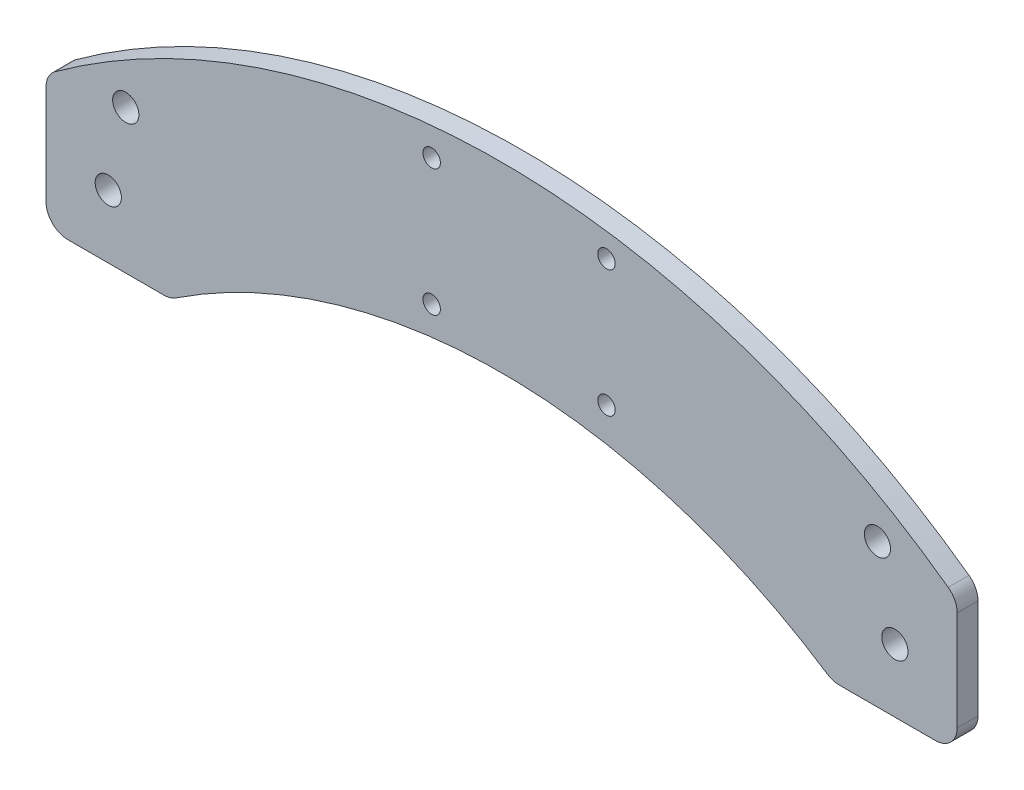
ISO-10303-21;
HEADER;
FILE_DESCRIPTION(('STEP AP214'),'2;1');
FILE_NAME('part.step','',(''),(''),'','','');
FILE_SCHEMA(('AUTOMOTIVE_DESIGN { 1 0 10303 214 1 1 1 1 }'));
ENDSEC;
DATA;
#1=APPLICATION_CONTEXT('core data for automotive mechanical design processes');
#2=APPLICATION_PROTOCOL_DEFINITION('international standard','automotive_design',2000,#1);
#3=PRODUCT_CONTEXT('',#1,'mechanical');
#4=PRODUCT('Part','Part','',(#3));
#5=PRODUCT_RELATED_PRODUCT_CATEGORY('part','',(#4));
#6=PRODUCT_DEFINITION_FORMATION('','',#4);
#7=PRODUCT_DEFINITION_CONTEXT('part definition',#1,'design');
#8=PRODUCT_DEFINITION('design','',#6,#7);
#9=PRODUCT_DEFINITION_SHAPE('','',#8);
#10=(LENGTH_UNIT() NAMED_UNIT(*) SI_UNIT(.MILLI.,.METRE.));
#11=(NAMED_UNIT(*) PLANE_ANGLE_UNIT() SI_UNIT($,.RADIAN.));
#12=(NAMED_UNIT(*) SI_UNIT($,.STERADIAN.) SOLID_ANGLE_UNIT());
#13=UNCERTAINTY_MEASURE_WITH_UNIT(LENGTH_MEASURE(1.E-05),#10,'distance_accuracy_value','');
#14=(GEOMETRIC_REPRESENTATION_CONTEXT(3) GLOBAL_UNCERTAINTY_ASSIGNED_CONTEXT((#13)) GLOBAL_UNIT_ASSIGNED_CONTEXT((#10,
#11,#12)) REPRESENTATION_CONTEXT('',''));
#15=CARTESIAN_POINT('',(0.,0.,0.));
#16=DIRECTION('',(0.,0.,1.));
#17=DIRECTION('',(1.,0.,0.));
#18=AXIS2_PLACEMENT_3D('',#15,#16,#17);
#19=CARTESIAN_POINT('',(-9.24999999999999,13.3361012676361,0.));
#20=DIRECTION('',(0.,0.,1.));
#21=DIRECTION('',(1.,0.,0.));
#22=AXIS2_PLACEMENT_3D('',#19,#20,#21);
#23=PLANE('',#22);
#24=DIRECTION('',(0.,-1.,0.));
#25=VECTOR('',#24,1.);
#26=CARTESIAN_POINT('',(-10.,10.,0.));
#27=LINE('',#26,#25);
#28=CARTESIAN_POINT('',(-10.,10.,0.));
#29=VERTEX_POINT('',#28);
#30=CARTESIAN_POINT('',(-10.,-10.,0.));
#31=VERTEX_POINT('',#30);
#32=EDGE_CURVE('E62',#29,#31,#27,.T.);
#33=ORIENTED_EDGE('',*,*,#32,.T.);
#34=DIRECTION('',(1.,0.,0.));
#35=VECTOR('',#34,1.);
#36=CARTESIAN_POINT('',(-10.,-10.,0.));
#37=LINE('',#36,#35);
#38=CARTESIAN_POINT('',(10.,-10.,0.));
#39=VERTEX_POINT('',#38);
#40=EDGE_CURVE('E217',#31,#39,#37,.T.);
#41=ORIENTED_EDGE('',*,*,#40,.T.);
#42=DIRECTION('',(0.,1.,0.));
#43=VECTOR('',#42,1.);
#44=CARTESIAN_POINT('',(9.99999999999999,10.,0.));
#45=LINE('',#44,#43);
#46=CARTESIAN_POINT('',(9.99999999999999,10.,0.));
#47=VERTEX_POINT('',#46);
#48=EDGE_CURVE('E220',#39,#47,#45,.T.);
#49=ORIENTED_EDGE('',*,*,#48,.T.);
#50=DIRECTION('',(-1.,0.,0.));
#51=VECTOR('',#50,1.);
#52=CARTESIAN_POINT('',(-10.,10.,0.));
#53=LINE('',#52,#51);
#54=EDGE_CURVE('E209',#47,#29,#53,.T.);
#55=ORIENTED_EDGE('',*,*,#54,.T.);
#56=EDGE_LOOP('',(#33,#41,#49,#55));
#57=FACE_BOUND('',#56,.T.);
#58=CARTESIAN_POINT('',(3.99999999999999,18.4000000000001,0.));
#59=DIRECTION('',(0.,0.,1.));
#60=DIRECTION('',(1.,0.,0.));
#61=AXIS2_PLACEMENT_3D('',#58,#59,#60);
#62=CIRCLE('',#61,3.);
#63=CARTESIAN_POINT('',(6.99999999999999,18.4000000000001,0.));
#64=VERTEX_POINT('',#63);
#65=EDGE_CURVE('E236',#64,#64,#62,.T.);
#66=ORIENTED_EDGE('',*,*,#65,.T.);
#67=EDGE_LOOP('',(#66));
#68=FACE_BOUND('',#67,.T.);
#69=CARTESIAN_POINT('',(114.,43.4000000000001,0.));
#70=DIRECTION('',(0.,0.,1.));
#71=DIRECTION('',(1.,0.,0.));
#72=AXIS2_PLACEMENT_3D('',#69,#70,#71);
#73=CIRCLE('',#72,2.);
#74=CARTESIAN_POINT('',(116.,43.4000000000001,0.));
#75=VERTEX_POINT('',#74);
#76=EDGE_CURVE('E255',#75,#75,#73,.T.);
#77=ORIENTED_EDGE('',*,*,#76,.T.);
#78=EDGE_LOOP('',(#77));
#79=FACE_BOUND('',#78,.T.);
#80=CARTESIAN_POINT('',(74.,43.4000000000001,0.));
#81=DIRECTION('',(0.,0.,1.));
#82=DIRECTION('',(1.,0.,0.));
#83=AXIS2_PLACEMENT_3D('',#80,#81,#82);
#84=CIRCLE('',#83,2.);
#85=CARTESIAN_POINT('',(76.,43.4000000000001,0.));
#86=VERTEX_POINT('',#85);
#87=EDGE_CURVE('E267',#86,#86,#84,.T.);
#88=ORIENTED_EDGE('',*,*,#87,.T.);
#89=EDGE_LOOP('',(#88));
#90=FACE_BOUND('',#89,.T.);
#91=CARTESIAN_POINT('',(-9.24999999999999,13.3361012676361,0.));
#92=DIRECTION('',(0.,0.,1.));
#93=DIRECTION('',(1.,0.,0.));
#94=AXIS2_PLACEMENT_3D('',#91,#92,#93);
#95=CIRCLE('',#94,5.00000000000001);
#96=CARTESIAN_POINT('',(-12.1863905325444,17.3830273406431,0.));
#97=VERTEX_POINT('',#96);
#98=CARTESIAN_POINT('',(-14.25,13.3361012676361,0.));
#99=VERTEX_POINT('',#98);
#100=EDGE_CURVE('E273',#97,#99,#95,.T.);
#101=ORIENTED_EDGE('',*,*,#100,.F.);
#102=CARTESIAN_POINT('',(90.0000000000001,-123.45,0.));
#103=DIRECTION('',(0.,0.,1.));
#104=DIRECTION('',(-1.,0.,0.));
#105=AXIS2_PLACEMENT_3D('',#102,#103,#104);
#106=CIRCLE('',#105,174.);
#107=CARTESIAN_POINT('',(192.186390532544,17.3830273406432,0.));
#108=VERTEX_POINT('',#107);
#109=EDGE_CURVE('E280',#108,#97,#106,.T.);
#110=ORIENTED_EDGE('',*,*,#109,.F.);
#111=CARTESIAN_POINT('',(189.25,13.3361012676362,0.));
#112=DIRECTION('',(0.,0.,1.));
#113=DIRECTION('',(1.,0.,0.));
#114=AXIS2_PLACEMENT_3D('',#111,#112,#113);
#115=CIRCLE('',#114,5.);
#116=CARTESIAN_POINT('',(194.25,13.3361012676362,0.));
#117=VERTEX_POINT('',#116);
#118=EDGE_CURVE('E323',#117,#108,#115,.T.);
#119=ORIENTED_EDGE('',*,*,#118,.F.);
#120=DIRECTION('',(0.,1.,0.));
#121=VECTOR('',#120,1.);
#122=CARTESIAN_POINT('',(194.25,13.3361012676362,0.));
#123=LINE('',#122,#121);
#124=CARTESIAN_POINT('',(194.25,-9.4499999999998,0.));
#125=VERTEX_POINT('',#124);
#126=EDGE_CURVE('E321',#125,#117,#123,.T.);
#127=ORIENTED_EDGE('',*,*,#126,.F.);
#128=CARTESIAN_POINT('',(189.25,-9.4499999999998,0.));
#129=DIRECTION('',(0.,0.,1.));
#130=DIRECTION('',(-1.,0.,0.));
#131=AXIS2_PLACEMENT_3D('',#128,#129,#130);
#132=CIRCLE('',#131,4.99999999999999);
#133=CARTESIAN_POINT('',(189.25,-14.4499999999998,0.));
#134=VERTEX_POINT('',#133);
#135=EDGE_CURVE('E319',#134,#125,#132,.T.);
#136=ORIENTED_EDGE('',*,*,#135,.F.);
#137=DIRECTION('',(1.,0.,0.));
#138=VECTOR('',#137,1.);
#139=CARTESIAN_POINT('',(189.25,-14.4499999999998,0.));
#140=LINE('',#139,#138);
#141=CARTESIAN_POINT('',(167.269740757325,-14.4499999999998,0.));
#142=VERTEX_POINT('',#141);
#143=EDGE_CURVE('E317',#142,#134,#140,.T.);
#144=ORIENTED_EDGE('',*,*,#143,.F.);
#145=CARTESIAN_POINT('',(167.269740757325,-9.44999999999981,0.));
#146=DIRECTION('',(0.,0.,1.));
#147=DIRECTION('',(-1.,0.,0.));
#148=AXIS2_PLACEMENT_3D('',#145,#146,#147);
#149=CIRCLE('',#148,5.00000000000001);
#150=CARTESIAN_POINT('',(164.510107158849,-13.6194630831993,0.));
#151=VERTEX_POINT('',#150);
#152=EDGE_CURVE('E315',#151,#142,#149,.T.);
#153=ORIENTED_EDGE('',*,*,#152,.F.);
#154=CARTESIAN_POINT('',(90.0000000000001,-126.194966329584,0.));
#155=DIRECTION('',(0.,0.,-1.));
#156=DIRECTION('',(1.,0.,0.));
#157=AXIS2_PLACEMENT_3D('',#154,#155,#156);
#158=CIRCLE('',#157,135.);
#159=CARTESIAN_POINT('',(15.4898928411513,-13.6194630831994,0.));
#160=VERTEX_POINT('',#159);
#161=EDGE_CURVE('E313',#160,#151,#158,.T.);
#162=ORIENTED_EDGE('',*,*,#161,.F.);
#163=CARTESIAN_POINT('',(12.7302592426754,-9.44999999999993,0.));
#164=DIRECTION('',(0.,0.,1.));
#165=DIRECTION('',(-1.,0.,0.));
#166=AXIS2_PLACEMENT_3D('',#163,#164,#165);
#167=CIRCLE('',#166,5.00000000000001);
#168=CARTESIAN_POINT('',(12.7302592426754,-14.4499999999999,0.));
#169=VERTEX_POINT('',#168);
#170=EDGE_CURVE('E311',#169,#160,#167,.T.);
#171=ORIENTED_EDGE('',*,*,#170,.F.);
#172=DIRECTION('',(1.,0.,0.));
#173=VECTOR('',#172,1.);
#174=CARTESIAN_POINT('',(12.7302592426754,-14.4499999999999,0.));
#175=LINE('',#174,#173);
#176=CARTESIAN_POINT('',(-9.25,-14.4499999999999,0.));
#177=VERTEX_POINT('',#176);
#178=EDGE_CURVE('E309',#177,#169,#175,.T.);
#179=ORIENTED_EDGE('',*,*,#178,.F.);
#180=CARTESIAN_POINT('',(-9.25,-9.44999999999995,0.));
#181=DIRECTION('',(0.,0.,1.));
#182=DIRECTION('',(1.,0.,0.));
#183=AXIS2_PLACEMENT_3D('',#180,#181,#182);
#184=CIRCLE('',#183,5.);
#185=CARTESIAN_POINT('',(-14.25,-9.44999999999995,0.));
#186=VERTEX_POINT('',#185);
#187=EDGE_CURVE('E307',#186,#177,#184,.T.);
#188=ORIENTED_EDGE('',*,*,#187,.F.);
#189=DIRECTION('',(0.,-1.,0.));
#190=VECTOR('',#189,1.);
#191=CARTESIAN_POINT('',(-14.25,-9.44999999999995,0.));
#192=LINE('',#191,#190);
#193=EDGE_CURVE('E305',#99,#186,#192,.T.);
#194=ORIENTED_EDGE('',*,*,#193,.F.);
#195=EDGE_LOOP('',(#101,#110,#119,#127,#136,#144,#153,#162,#171,#179,#188,#194));
#196=FACE_BOUND('',#195,.T.);
#197=CARTESIAN_POINT('',(74.0000000000001,14.4000000000001,0.));
#198=DIRECTION('',(0.,0.,1.));
#199=DIRECTION('',(1.,0.,0.));
#200=AXIS2_PLACEMENT_3D('',#197,#198,#199);
#201=CIRCLE('',#200,2.);
#202=CARTESIAN_POINT('',(76.0000000000001,14.4000000000001,0.));
#203=VERTEX_POINT('',#202);
#204=EDGE_CURVE('E261',#203,#203,#201,.T.);
#205=ORIENTED_EDGE('',*,*,#204,.T.);
#206=EDGE_LOOP('',(#205));
#207=FACE_BOUND('',#206,.T.);
#208=CARTESIAN_POINT('',(114.,14.4000000000001,0.));
#209=DIRECTION('',(0.,0.,1.));
#210=DIRECTION('',(1.,0.,0.));
#211=AXIS2_PLACEMENT_3D('',#208,#209,#210);
#212=CIRCLE('',#211,2.);
#213=CARTESIAN_POINT('',(116.,14.4000000000001,0.));
#214=VERTEX_POINT('',#213);
#215=EDGE_CURVE('E251',#214,#214,#212,.T.);
#216=ORIENTED_EDGE('',*,*,#215,.T.);
#217=EDGE_LOOP('',(#216));
#218=FACE_BOUND('',#217,.T.);
#219=CARTESIAN_POINT('',(176.,18.4000000000002,0.));
#220=DIRECTION('',(0.,0.,1.));
#221=DIRECTION('',(1.,0.,0.));
#222=AXIS2_PLACEMENT_3D('',#219,#220,#221);
#223=CIRCLE('',#222,2.99999999999999);
#224=CARTESIAN_POINT('',(179.,18.4000000000002,0.));
#225=VERTEX_POINT('',#224);
#226=EDGE_CURVE('E237',#225,#225,#223,.T.);
#227=ORIENTED_EDGE('',*,*,#226,.T.);
#228=EDGE_LOOP('',(#227));
#229=FACE_BOUND('',#228,.T.);
#230=DIRECTION('',(0.,-1.,0.));
#231=VECTOR('',#230,1.);
#232=CARTESIAN_POINT('',(170.,10.0000000000002,0.));
#233=LINE('',#232,#231);
#234=CARTESIAN_POINT('',(170.,10.0000000000002,0.));
#235=VERTEX_POINT('',#234);
#236=CARTESIAN_POINT('',(170.,-9.99999999999978,0.));
#237=VERTEX_POINT('',#236);
#238=EDGE_CURVE('E54',#235,#237,#233,.T.);
#239=ORIENTED_EDGE('',*,*,#238,.T.);
#240=DIRECTION('',(1.,0.,0.));
#241=VECTOR('',#240,1.);
#242=CARTESIAN_POINT('',(170.,-9.99999999999978,0.));
#243=LINE('',#242,#241);
#244=CARTESIAN_POINT('',(190.,-9.99999999999978,0.));
#245=VERTEX_POINT('',#244);
#246=EDGE_CURVE('E197',#237,#245,#243,.T.);
#247=ORIENTED_EDGE('',*,*,#246,.T.);
#248=DIRECTION('',(0.,1.,0.));
#249=VECTOR('',#248,1.);
#250=CARTESIAN_POINT('',(190.,10.0000000000002,0.));
#251=LINE('',#250,#249);
#252=CARTESIAN_POINT('',(190.,10.0000000000002,0.));
#253=VERTEX_POINT('',#252);
#254=EDGE_CURVE('E392',#245,#253,#251,.T.);
#255=ORIENTED_EDGE('',*,*,#254,.T.);
#256=DIRECTION('',(-1.,0.,0.));
#257=VECTOR('',#256,1.);
#258=CARTESIAN_POINT('',(170.,10.0000000000002,0.));
#259=LINE('',#258,#257);
#260=EDGE_CURVE('E193',#253,#235,#259,.T.);
#261=ORIENTED_EDGE('',*,*,#260,.T.);
#262=EDGE_LOOP('',(#239,#247,#255,#261));
#263=FACE_BOUND('',#262,.T.);
#264=ADVANCED_FACE('F37',(#57,#68,#79,#90,#196,#207,#218,#229,#263),#23,.F.);
#265=CARTESIAN_POINT('',(-9.24999999999999,13.3361012676361,4.7625));
#266=DIRECTION('',(0.,0.,1.));
#267=DIRECTION('',(1.,0.,0.));
#268=AXIS2_PLACEMENT_3D('',#265,#266,#267);
#269=PLANE('',#268);
#270=CARTESIAN_POINT('',(3.99999999999999,18.4000000000001,4.7625));
#271=DIRECTION('',(0.,0.,1.));
#272=DIRECTION('',(1.,0.,0.));
#273=AXIS2_PLACEMENT_3D('',#270,#271,#272);
#274=CIRCLE('',#273,3.);
#275=CARTESIAN_POINT('',(6.99999999999999,18.4000000000001,4.7625));
#276=VERTEX_POINT('',#275);
#277=EDGE_CURVE('E240',#276,#276,#274,.T.);
#278=ORIENTED_EDGE('',*,*,#277,.F.);
#279=EDGE_LOOP('',(#278));
#280=FACE_BOUND('',#279,.T.);
#281=CARTESIAN_POINT('',(180.,2.10499963540171E-13,4.7625));
#282=DIRECTION('',(0.,0.,1.));
#283=DIRECTION('',(1.,0.,0.));
#284=AXIS2_PLACEMENT_3D('',#281,#282,#283);
#285=CIRCLE('',#284,3.00000000000018);
#286=CARTESIAN_POINT('',(183.,2.10499963540171E-13,4.7625));
#287=VERTEX_POINT('',#286);
#288=EDGE_CURVE('E248',#287,#287,#285,.T.);
#289=ORIENTED_EDGE('',*,*,#288,.F.);
#290=EDGE_LOOP('',(#289));
#291=FACE_BOUND('',#290,.T.);
#292=CARTESIAN_POINT('',(114.,43.4000000000001,4.7625));
#293=DIRECTION('',(0.,0.,1.));
#294=DIRECTION('',(1.,0.,0.));
#295=AXIS2_PLACEMENT_3D('',#292,#293,#294);
#296=CIRCLE('',#295,2.);
#297=CARTESIAN_POINT('',(116.,43.4000000000001,4.7625));
#298=VERTEX_POINT('',#297);
#299=EDGE_CURVE('E258',#298,#298,#296,.T.);
#300=ORIENTED_EDGE('',*,*,#299,.F.);
#301=EDGE_LOOP('',(#300));
#302=FACE_BOUND('',#301,.T.);
#303=CARTESIAN_POINT('',(74.,43.4000000000001,4.7625));
#304=DIRECTION('',(0.,0.,1.));
#305=DIRECTION('',(1.,0.,0.));
#306=AXIS2_PLACEMENT_3D('',#303,#304,#305);
#307=CIRCLE('',#306,2.);
#308=CARTESIAN_POINT('',(76.,43.4000000000001,4.7625));
#309=VERTEX_POINT('',#308);
#310=EDGE_CURVE('E270',#309,#309,#307,.T.);
#311=ORIENTED_EDGE('',*,*,#310,.F.);
#312=EDGE_LOOP('',(#311));
#313=FACE_BOUND('',#312,.T.);
#314=CARTESIAN_POINT('',(-9.24999999999999,13.3361012676361,4.7625));
#315=DIRECTION('',(0.,0.,1.));
#316=DIRECTION('',(1.,0.,0.));
#317=AXIS2_PLACEMENT_3D('',#314,#315,#316);
#318=CIRCLE('',#317,5.00000000000001);
#319=CARTESIAN_POINT('',(-12.1863905325444,17.3830273406431,4.7625));
#320=VERTEX_POINT('',#319);
#321=CARTESIAN_POINT('',(-14.25,13.3361012676361,4.7625));
#322=VERTEX_POINT('',#321);
#323=EDGE_CURVE('E276',#320,#322,#318,.T.);
#324=ORIENTED_EDGE('',*,*,#323,.T.);
#325=DIRECTION('',(0.,-1.,0.));
#326=VECTOR('',#325,1.);
#327=CARTESIAN_POINT('',(-14.25,-9.44999999999995,4.7625));
#328=LINE('',#327,#326);
#329=CARTESIAN_POINT('',(-14.25,-9.44999999999995,4.7625));
#330=VERTEX_POINT('',#329);
#331=EDGE_CURVE('E279',#322,#330,#328,.T.);
#332=ORIENTED_EDGE('',*,*,#331,.T.);
#333=CARTESIAN_POINT('',(-9.25,-9.44999999999995,4.7625));
#334=DIRECTION('',(0.,0.,1.));
#335=DIRECTION('',(1.,0.,0.));
#336=AXIS2_PLACEMENT_3D('',#333,#334,#335);
#337=CIRCLE('',#336,5.);
#338=CARTESIAN_POINT('',(-9.25,-14.4499999999999,4.7625));
#339=VERTEX_POINT('',#338);
#340=EDGE_CURVE('E282',#330,#339,#337,.T.);
#341=ORIENTED_EDGE('',*,*,#340,.T.);
#342=DIRECTION('',(1.,0.,0.));
#343=VECTOR('',#342,1.);
#344=CARTESIAN_POINT('',(12.7302592426754,-14.4499999999999,4.7625));
#345=LINE('',#344,#343);
#346=CARTESIAN_POINT('',(12.7302592426754,-14.4499999999999,4.7625));
#347=VERTEX_POINT('',#346);
#348=EDGE_CURVE('E284',#339,#347,#345,.T.);
#349=ORIENTED_EDGE('',*,*,#348,.T.);
#350=CARTESIAN_POINT('',(12.7302592426754,-9.44999999999993,4.7625));
#351=DIRECTION('',(0.,0.,1.));
#352=DIRECTION('',(-1.,0.,0.));
#353=AXIS2_PLACEMENT_3D('',#350,#351,#352);
#354=CIRCLE('',#353,5.00000000000001);
#355=CARTESIAN_POINT('',(15.4898928411513,-13.6194630831994,4.7625));
#356=VERTEX_POINT('',#355);
#357=EDGE_CURVE('E286',#347,#356,#354,.T.);
#358=ORIENTED_EDGE('',*,*,#357,.T.);
#359=CARTESIAN_POINT('',(90.0000000000001,-126.194966329584,4.7625));
#360=DIRECTION('',(0.,0.,-1.));
#361=DIRECTION('',(1.,0.,0.));
#362=AXIS2_PLACEMENT_3D('',#359,#360,#361);
#363=CIRCLE('',#362,135.);
#364=CARTESIAN_POINT('',(164.510107158849,-13.6194630831993,4.7625));
#365=VERTEX_POINT('',#364);
#366=EDGE_CURVE('E288',#356,#365,#363,.T.);
#367=ORIENTED_EDGE('',*,*,#366,.T.);
#368=CARTESIAN_POINT('',(167.269740757325,-9.44999999999981,4.7625));
#369=DIRECTION('',(0.,0.,1.));
#370=DIRECTION('',(-1.,0.,0.));
#371=AXIS2_PLACEMENT_3D('',#368,#369,#370);
#372=CIRCLE('',#371,5.00000000000001);
#373=CARTESIAN_POINT('',(167.269740757325,-14.4499999999998,4.7625));
#374=VERTEX_POINT('',#373);
#375=EDGE_CURVE('E290',#365,#374,#372,.T.);
#376=ORIENTED_EDGE('',*,*,#375,.T.);
#377=DIRECTION('',(1.,0.,0.));
#378=VECTOR('',#377,1.);
#379=CARTESIAN_POINT('',(189.25,-14.4499999999998,4.7625));
#380=LINE('',#379,#378);
#381=CARTESIAN_POINT('',(189.25,-14.4499999999998,4.7625));
#382=VERTEX_POINT('',#381);
#383=EDGE_CURVE('E292',#374,#382,#380,.T.);
#384=ORIENTED_EDGE('',*,*,#383,.T.);
#385=CARTESIAN_POINT('',(189.25,-9.4499999999998,4.7625));
#386=DIRECTION('',(0.,0.,1.));
#387=DIRECTION('',(-1.,0.,0.));
#388=AXIS2_PLACEMENT_3D('',#385,#386,#387);
#389=CIRCLE('',#388,4.99999999999999);
#390=CARTESIAN_POINT('',(194.25,-9.4499999999998,4.7625));
#391=VERTEX_POINT('',#390);
#392=EDGE_CURVE('E294',#382,#391,#389,.T.);
#393=ORIENTED_EDGE('',*,*,#392,.T.);
#394=DIRECTION('',(0.,1.,0.));
#395=VECTOR('',#394,1.);
#396=CARTESIAN_POINT('',(194.25,13.3361012676362,4.7625));
#397=LINE('',#396,#395);
#398=CARTESIAN_POINT('',(194.25,13.3361012676362,4.7625));
#399=VERTEX_POINT('',#398);
#400=EDGE_CURVE('E296',#391,#399,#397,.T.);
#401=ORIENTED_EDGE('',*,*,#400,.T.);
#402=CARTESIAN_POINT('',(189.25,13.3361012676362,4.7625));
#403=DIRECTION('',(0.,0.,1.));
#404=DIRECTION('',(1.,0.,0.));
#405=AXIS2_PLACEMENT_3D('',#402,#403,#404);
#406=CIRCLE('',#405,5.);
#407=CARTESIAN_POINT('',(192.186390532544,17.3830273406432,4.7625));
#408=VERTEX_POINT('',#407);
#409=EDGE_CURVE('E298',#399,#408,#406,.T.);
#410=ORIENTED_EDGE('',*,*,#409,.T.);
#411=CARTESIAN_POINT('',(90.0000000000001,-123.45,4.7625));
#412=DIRECTION('',(0.,0.,1.));
#413=DIRECTION('',(-1.,0.,0.));
#414=AXIS2_PLACEMENT_3D('',#411,#412,#413);
#415=CIRCLE('',#414,174.);
#416=EDGE_CURVE('E300',#408,#320,#415,.T.);
#417=ORIENTED_EDGE('',*,*,#416,.T.);
#418=EDGE_LOOP('',(#324,#332,#341,#349,#358,#367,#376,#384,#393,#401,#410,#417));
#419=FACE_BOUND('',#418,.T.);
#420=CARTESIAN_POINT('',(74.0000000000001,14.4000000000001,4.7625));
#421=DIRECTION('',(0.,0.,1.));
#422=DIRECTION('',(1.,0.,0.));
#423=AXIS2_PLACEMENT_3D('',#420,#421,#422);
#424=CIRCLE('',#423,2.);
#425=CARTESIAN_POINT('',(76.0000000000001,14.4000000000001,4.7625));
#426=VERTEX_POINT('',#425);
#427=EDGE_CURVE('E264',#426,#426,#424,.T.);
#428=ORIENTED_EDGE('',*,*,#427,.F.);
#429=EDGE_LOOP('',(#428));
#430=FACE_BOUND('',#429,.T.);
#431=CARTESIAN_POINT('',(114.,14.4000000000001,4.7625));
#432=DIRECTION('',(0.,0.,1.));
#433=DIRECTION('',(1.,0.,0.));
#434=AXIS2_PLACEMENT_3D('',#431,#432,#433);
#435=CIRCLE('',#434,2.);
#436=CARTESIAN_POINT('',(116.,14.4000000000001,4.7625));
#437=VERTEX_POINT('',#436);
#438=EDGE_CURVE('E252',#437,#437,#435,.T.);
#439=ORIENTED_EDGE('',*,*,#438,.F.);
#440=EDGE_LOOP('',(#439));
#441=FACE_BOUND('',#440,.T.);
#442=CARTESIAN_POINT('',(0.,0.,4.7625));
#443=DIRECTION('',(0.,0.,1.));
#444=DIRECTION('',(1.,0.,0.));
#445=AXIS2_PLACEMENT_3D('',#442,#443,#444);
#446=CIRCLE('',#445,3.);
#447=CARTESIAN_POINT('',(3.,0.,4.7625));
#448=VERTEX_POINT('',#447);
#449=EDGE_CURVE('E243',#448,#448,#446,.T.);
#450=ORIENTED_EDGE('',*,*,#449,.F.);
#451=EDGE_LOOP('',(#450));
#452=FACE_BOUND('',#451,.T.);
#453=CARTESIAN_POINT('',(176.,18.4000000000002,4.7625));
#454=DIRECTION('',(0.,0.,1.));
#455=DIRECTION('',(1.,0.,0.));
#456=AXIS2_PLACEMENT_3D('',#453,#454,#455);
#457=CIRCLE('',#456,2.99999999999999);
#458=CARTESIAN_POINT('',(179.,18.4000000000002,4.7625));
#459=VERTEX_POINT('',#458);
#460=EDGE_CURVE('E233',#459,#459,#457,.T.);
#461=ORIENTED_EDGE('',*,*,#460,.F.);
#462=EDGE_LOOP('',(#461));
#463=FACE_BOUND('',#462,.T.);
#464=ADVANCED_FACE('F370',(#280,#291,#302,#313,#419,#430,#441,#452,#463),#269,.T.);
#465=CARTESIAN_POINT('',(-9.24999999999999,13.3361012676361,4.7625));
#466=DIRECTION('',(0.,0.,-1.));
#467=DIRECTION('',(-1.,0.,0.));
#468=AXIS2_PLACEMENT_3D('',#465,#466,#467);
#469=CYLINDRICAL_SURFACE('',#468,5.00000000000001);
#470=ORIENTED_EDGE('',*,*,#100,.T.);
#471=DIRECTION('',(0.,0.,-1.));
#472=VECTOR('',#471,1.);
#473=CARTESIAN_POINT('',(-14.25,13.3361012676361,4.7625));
#474=LINE('',#473,#472);
#475=EDGE_CURVE('E11',#322,#99,#474,.T.);
#476=ORIENTED_EDGE('',*,*,#475,.F.);
#477=ORIENTED_EDGE('',*,*,#323,.F.);
#478=DIRECTION('',(0.,0.,-1.));
#479=VECTOR('',#478,1.);
#480=CARTESIAN_POINT('',(-12.1863905325444,17.3830273406431,4.7625));
#481=LINE('',#480,#479);
#482=EDGE_CURVE('E302',#320,#97,#481,.T.);
#483=ORIENTED_EDGE('',*,*,#482,.T.);
#484=EDGE_LOOP('',(#470,#476,#477,#483));
#485=FACE_BOUND('',#484,.T.);
#486=ADVANCED_FACE('F39',(#485),#469,.T.);
#487=CARTESIAN_POINT('',(-14.25,-9.44999999999995,4.7625));
#488=DIRECTION('',(1.,0.,0.));
#489=DIRECTION('',(0.,1.,0.));
#490=AXIS2_PLACEMENT_3D('',#487,#488,#489);
#491=PLANE('',#490);
#492=ORIENTED_EDGE('',*,*,#193,.T.);
#493=DIRECTION('',(0.,0.,-1.));
#494=VECTOR('',#493,1.);
#495=CARTESIAN_POINT('',(-14.25,-9.44999999999995,4.7625));
#496=LINE('',#495,#494);
#497=EDGE_CURVE('E46',#330,#186,#496,.T.);
#498=ORIENTED_EDGE('',*,*,#497,.F.);
#499=ORIENTED_EDGE('',*,*,#331,.F.);
#500=ORIENTED_EDGE('',*,*,#475,.T.);
#501=EDGE_LOOP('',(#492,#498,#499,#500));
#502=FACE_BOUND('',#501,.T.);
#503=ADVANCED_FACE('F496',(#502),#491,.F.);
#504=CARTESIAN_POINT('',(-9.25,-9.44999999999995,4.7625));
#505=DIRECTION('',(0.,0.,-1.));
#506=DIRECTION('',(-1.,0.,0.));
#507=AXIS2_PLACEMENT_3D('',#504,#505,#506);
#508=CYLINDRICAL_SURFACE('',#507,5.);
#509=ORIENTED_EDGE('',*,*,#187,.T.);
#510=DIRECTION('',(0.,0.,-1.));
#511=VECTOR('',#510,1.);
#512=CARTESIAN_POINT('',(-9.25,-14.4499999999999,4.7625));
#513=LINE('',#512,#511);
#514=EDGE_CURVE('E352',#339,#177,#513,.T.);
#515=ORIENTED_EDGE('',*,*,#514,.F.);
#516=ORIENTED_EDGE('',*,*,#340,.F.);
#517=ORIENTED_EDGE('',*,*,#497,.T.);
#518=EDGE_LOOP('',(#509,#515,#516,#517));
#519=FACE_BOUND('',#518,.T.);
#520=ADVANCED_FACE('F493',(#519),#508,.T.);
#521=CARTESIAN_POINT('',(12.7302592426754,-14.4499999999999,4.7625));
#522=DIRECTION('',(0.,1.,0.));
#523=DIRECTION('',(-1.,0.,0.));
#524=AXIS2_PLACEMENT_3D('',#521,#522,#523);
#525=PLANE('',#524);
#526=ORIENTED_EDGE('',*,*,#178,.T.);
#527=DIRECTION('',(0.,0.,-1.));
#528=VECTOR('',#527,1.);
#529=CARTESIAN_POINT('',(12.7302592426754,-14.4499999999999,4.7625));
#530=LINE('',#529,#528);
#531=EDGE_CURVE('E349',#347,#169,#530,.T.);
#532=ORIENTED_EDGE('',*,*,#531,.F.);
#533=ORIENTED_EDGE('',*,*,#348,.F.);
#534=ORIENTED_EDGE('',*,*,#514,.T.);
#535=EDGE_LOOP('',(#526,#532,#533,#534));
#536=FACE_BOUND('',#535,.T.);
#537=ADVANCED_FACE('F489',(#536),#525,.F.);
#538=CARTESIAN_POINT('',(12.7302592426754,-9.44999999999993,4.7625));
#539=DIRECTION('',(0.,0.,-1.));
#540=DIRECTION('',(-1.,0.,0.));
#541=AXIS2_PLACEMENT_3D('',#538,#539,#540);
#542=CYLINDRICAL_SURFACE('',#541,5.00000000000001);
#543=ORIENTED_EDGE('',*,*,#170,.T.);
#544=DIRECTION('',(0.,0.,-1.));
#545=VECTOR('',#544,1.);
#546=CARTESIAN_POINT('',(15.4898928411513,-13.6194630831994,4.7625));
#547=LINE('',#546,#545);
#548=EDGE_CURVE('E346',#356,#160,#547,.T.);
#549=ORIENTED_EDGE('',*,*,#548,.F.);
#550=ORIENTED_EDGE('',*,*,#357,.F.);
#551=ORIENTED_EDGE('',*,*,#531,.T.);
#552=EDGE_LOOP('',(#543,#549,#550,#551));
#553=FACE_BOUND('',#552,.T.);
#554=ADVANCED_FACE('F485',(#553),#542,.T.);
#555=CARTESIAN_POINT('',(90.0000000000001,-126.194966329584,4.7625));
#556=DIRECTION('',(0.,0.,-1.));
#557=DIRECTION('',(-1.,0.,0.));
#558=AXIS2_PLACEMENT_3D('',#555,#556,#557);
#559=CYLINDRICAL_SURFACE('',#558,135.);
#560=ORIENTED_EDGE('',*,*,#161,.T.);
#561=DIRECTION('',(0.,0.,-1.));
#562=VECTOR('',#561,1.);
#563=CARTESIAN_POINT('',(164.510107158849,-13.6194630831993,4.7625));
#564=LINE('',#563,#562);
#565=EDGE_CURVE('E343',#365,#151,#564,.T.);
#566=ORIENTED_EDGE('',*,*,#565,.F.);
#567=ORIENTED_EDGE('',*,*,#366,.F.);
#568=ORIENTED_EDGE('',*,*,#548,.T.);
#569=EDGE_LOOP('',(#560,#566,#567,#568));
#570=FACE_BOUND('',#569,.T.);
#571=ADVANCED_FACE('F481',(#570),#559,.F.);
#572=CARTESIAN_POINT('',(167.269740757325,-9.44999999999981,4.7625));
#573=DIRECTION('',(0.,0.,-1.));
#574=DIRECTION('',(-1.,0.,0.));
#575=AXIS2_PLACEMENT_3D('',#572,#573,#574);
#576=CYLINDRICAL_SURFACE('',#575,5.00000000000001);
#577=ORIENTED_EDGE('',*,*,#152,.T.);
#578=DIRECTION('',(0.,0.,-1.));
#579=VECTOR('',#578,1.);
#580=CARTESIAN_POINT('',(167.269740757325,-14.4499999999998,4.7625));
#581=LINE('',#580,#579);
#582=EDGE_CURVE('E340',#374,#142,#581,.T.);
#583=ORIENTED_EDGE('',*,*,#582,.F.);
#584=ORIENTED_EDGE('',*,*,#375,.F.);
#585=ORIENTED_EDGE('',*,*,#565,.T.);
#586=EDGE_LOOP('',(#577,#583,#584,#585));
#587=FACE_BOUND('',#586,.T.);
#588=ADVANCED_FACE('F477',(#587),#576,.T.);
#589=CARTESIAN_POINT('',(189.25,-14.4499999999998,4.7625));
#590=DIRECTION('',(0.,1.,0.));
#591=DIRECTION('',(-1.,0.,0.));
#592=AXIS2_PLACEMENT_3D('',#589,#590,#591);
#593=PLANE('',#592);
#594=ORIENTED_EDGE('',*,*,#143,.T.);
#595=DIRECTION('',(0.,0.,-1.));
#596=VECTOR('',#595,1.);
#597=CARTESIAN_POINT('',(189.25,-14.4499999999998,4.7625));
#598=LINE('',#597,#596);
#599=EDGE_CURVE('E337',#382,#134,#598,.T.);
#600=ORIENTED_EDGE('',*,*,#599,.F.);
#601=ORIENTED_EDGE('',*,*,#383,.F.);
#602=ORIENTED_EDGE('',*,*,#582,.T.);
#603=EDGE_LOOP('',(#594,#600,#601,#602));
#604=FACE_BOUND('',#603,.T.);
#605=ADVANCED_FACE('F473',(#604),#593,.F.);
#606=CARTESIAN_POINT('',(189.25,-9.4499999999998,4.7625));
#607=DIRECTION('',(0.,0.,-1.));
#608=DIRECTION('',(-1.,0.,0.));
#609=AXIS2_PLACEMENT_3D('',#606,#607,#608);
#610=CYLINDRICAL_SURFACE('',#609,4.99999999999999);
#611=ORIENTED_EDGE('',*,*,#135,.T.);
#612=DIRECTION('',(0.,0.,-1.));
#613=VECTOR('',#612,1.);
#614=CARTESIAN_POINT('',(194.25,-9.4499999999998,4.7625));
#615=LINE('',#614,#613);
#616=EDGE_CURVE('E334',#391,#125,#615,.T.);
#617=ORIENTED_EDGE('',*,*,#616,.F.);
#618=ORIENTED_EDGE('',*,*,#392,.F.);
#619=ORIENTED_EDGE('',*,*,#599,.T.);
#620=EDGE_LOOP('',(#611,#617,#618,#619));
#621=FACE_BOUND('',#620,.T.);
#622=ADVANCED_FACE('F469',(#621),#610,.T.);
#623=CARTESIAN_POINT('',(194.25,13.3361012676362,4.7625));
#624=DIRECTION('',(-1.,0.,0.));
#625=DIRECTION('',(0.,-1.,0.));
#626=AXIS2_PLACEMENT_3D('',#623,#624,#625);
#627=PLANE('',#626);
#628=ORIENTED_EDGE('',*,*,#126,.T.);
#629=DIRECTION('',(0.,0.,-1.));
#630=VECTOR('',#629,1.);
#631=CARTESIAN_POINT('',(194.25,13.3361012676362,4.7625));
#632=LINE('',#631,#630);
#633=EDGE_CURVE('E331',#399,#117,#632,.T.);
#634=ORIENTED_EDGE('',*,*,#633,.F.);
#635=ORIENTED_EDGE('',*,*,#400,.F.);
#636=ORIENTED_EDGE('',*,*,#616,.T.);
#637=EDGE_LOOP('',(#628,#634,#635,#636));
#638=FACE_BOUND('',#637,.T.);
#639=ADVANCED_FACE('F465',(#638),#627,.F.);
#640=CARTESIAN_POINT('',(189.25,13.3361012676362,4.7625));
#641=DIRECTION('',(0.,0.,-1.));
#642=DIRECTION('',(-1.,0.,0.));
#643=AXIS2_PLACEMENT_3D('',#640,#641,#642);
#644=CYLINDRICAL_SURFACE('',#643,5.);
#645=ORIENTED_EDGE('',*,*,#118,.T.);
#646=DIRECTION('',(0.,0.,-1.));
#647=VECTOR('',#646,1.);
#648=CARTESIAN_POINT('',(192.186390532544,17.3830273406432,4.7625));
#649=LINE('',#648,#647);
#650=EDGE_CURVE('E328',#408,#108,#649,.T.);
#651=ORIENTED_EDGE('',*,*,#650,.F.);
#652=ORIENTED_EDGE('',*,*,#409,.F.);
#653=ORIENTED_EDGE('',*,*,#633,.T.);
#654=EDGE_LOOP('',(#645,#651,#652,#653));
#655=FACE_BOUND('',#654,.T.);
#656=ADVANCED_FACE('F461',(#655),#644,.T.);
#657=CARTESIAN_POINT('',(90.0000000000001,-123.45,4.7625));
#658=DIRECTION('',(0.,0.,-1.));
#659=DIRECTION('',(-1.,0.,0.));
#660=AXIS2_PLACEMENT_3D('',#657,#658,#659);
#661=CYLINDRICAL_SURFACE('',#660,174.);
#662=ORIENTED_EDGE('',*,*,#109,.T.);
#663=ORIENTED_EDGE('',*,*,#482,.F.);
#664=ORIENTED_EDGE('',*,*,#416,.F.);
#665=ORIENTED_EDGE('',*,*,#650,.T.);
#666=EDGE_LOOP('',(#662,#663,#664,#665));
#667=FACE_BOUND('',#666,.T.);
#668=ADVANCED_FACE('F456',(#667),#661,.T.);
#669=CARTESIAN_POINT('',(74.,43.4000000000001,4.7625));
#670=DIRECTION('',(0.,0.,-1.));
#671=DIRECTION('',(-1.,0.,0.));
#672=AXIS2_PLACEMENT_3D('',#669,#670,#671);
#673=CYLINDRICAL_SURFACE('',#672,2.);
#674=ORIENTED_EDGE('',*,*,#310,.T.);
#675=EDGE_LOOP('',(#674));
#676=FACE_BOUND('',#675,.T.);
#677=ORIENTED_EDGE('',*,*,#87,.F.);
#678=EDGE_LOOP('',(#677));
#679=FACE_BOUND('',#678,.T.);
#680=ADVANCED_FACE('F453',(#676,#679),#673,.F.);
#681=CARTESIAN_POINT('',(74.0000000000001,14.4000000000001,4.7625));
#682=DIRECTION('',(0.,0.,-1.));
#683=DIRECTION('',(-1.,0.,0.));
#684=AXIS2_PLACEMENT_3D('',#681,#682,#683);
#685=CYLINDRICAL_SURFACE('',#684,2.);
#686=ORIENTED_EDGE('',*,*,#427,.T.);
#687=EDGE_LOOP('',(#686));
#688=FACE_BOUND('',#687,.T.);
#689=ORIENTED_EDGE('',*,*,#204,.F.);
#690=EDGE_LOOP('',(#689));
#691=FACE_BOUND('',#690,.T.);
#692=ADVANCED_FACE('F449',(#688,#691),#685,.F.);
#693=CARTESIAN_POINT('',(114.,43.4000000000001,4.7625));
#694=DIRECTION('',(0.,0.,-1.));
#695=DIRECTION('',(-1.,0.,0.));
#696=AXIS2_PLACEMENT_3D('',#693,#694,#695);
#697=CYLINDRICAL_SURFACE('',#696,2.);
#698=ORIENTED_EDGE('',*,*,#299,.T.);
#699=EDGE_LOOP('',(#698));
#700=FACE_BOUND('',#699,.T.);
#701=ORIENTED_EDGE('',*,*,#76,.F.);
#702=EDGE_LOOP('',(#701));
#703=FACE_BOUND('',#702,.T.);
#704=ADVANCED_FACE('F445',(#700,#703),#697,.F.);
#705=CARTESIAN_POINT('',(114.,14.4000000000001,4.7625));
#706=DIRECTION('',(0.,0.,-1.));
#707=DIRECTION('',(-1.,0.,0.));
#708=AXIS2_PLACEMENT_3D('',#705,#706,#707);
#709=CYLINDRICAL_SURFACE('',#708,2.);
#710=ORIENTED_EDGE('',*,*,#438,.T.);
#711=EDGE_LOOP('',(#710));
#712=FACE_BOUND('',#711,.T.);
#713=ORIENTED_EDGE('',*,*,#215,.F.);
#714=EDGE_LOOP('',(#713));
#715=FACE_BOUND('',#714,.T.);
#716=ADVANCED_FACE('F441',(#712,#715),#709,.F.);
#717=CARTESIAN_POINT('',(180.,2.10499963540171E-13,4.7625));
#718=DIRECTION('',(0.,0.,-1.));
#719=DIRECTION('',(-1.,0.,0.));
#720=AXIS2_PLACEMENT_3D('',#717,#718,#719);
#721=CYLINDRICAL_SURFACE('',#720,3.00000000000018);
#722=CARTESIAN_POINT('',(180.,2.10499963540171E-13,0.00999999999999959));
#723=DIRECTION('',(0.,0.,1.));
#724=DIRECTION('',(1.,0.,0.));
#725=AXIS2_PLACEMENT_3D('',#722,#723,#724);
#726=CIRCLE('',#725,3.00000000000018);
#727=CARTESIAN_POINT('',(183.,2.10499963540171E-13,0.00999999999999959));
#728=VERTEX_POINT('',#727);
#729=EDGE_CURVE('E41',#728,#728,#726,.T.);
#730=ORIENTED_EDGE('',*,*,#729,.F.);
#731=EDGE_LOOP('',(#730));
#732=FACE_BOUND('',#731,.T.);
#733=ORIENTED_EDGE('',*,*,#288,.T.);
#734=EDGE_LOOP('',(#733));
#735=FACE_BOUND('',#734,.T.);
#736=ADVANCED_FACE('F366',(#732,#735),#721,.F.);
#737=CARTESIAN_POINT('',(0.,0.,4.7625));
#738=DIRECTION('',(0.,0.,-1.));
#739=DIRECTION('',(-1.,0.,0.));
#740=AXIS2_PLACEMENT_3D('',#737,#738,#739);
#741=CYLINDRICAL_SURFACE('',#740,3.);
#742=CARTESIAN_POINT('',(0.,0.,0.00999999999999959));
#743=DIRECTION('',(0.,0.,1.));
#744=DIRECTION('',(1.,0.,0.));
#745=AXIS2_PLACEMENT_3D('',#742,#743,#744);
#746=CIRCLE('',#745,3.);
#747=CARTESIAN_POINT('',(3.,0.,0.00999999999999959));
#748=VERTEX_POINT('',#747);
#749=EDGE_CURVE('E232',#748,#748,#746,.T.);
#750=ORIENTED_EDGE('',*,*,#749,.F.);
#751=EDGE_LOOP('',(#750));
#752=FACE_BOUND('',#751,.T.);
#753=ORIENTED_EDGE('',*,*,#449,.T.);
#754=EDGE_LOOP('',(#753));
#755=FACE_BOUND('',#754,.T.);
#756=ADVANCED_FACE('F362',(#752,#755),#741,.F.);
#757=CARTESIAN_POINT('',(3.99999999999999,18.4000000000001,4.7625));
#758=DIRECTION('',(0.,0.,-1.));
#759=DIRECTION('',(-1.,0.,0.));
#760=AXIS2_PLACEMENT_3D('',#757,#758,#759);
#761=CYLINDRICAL_SURFACE('',#760,3.);
#762=ORIENTED_EDGE('',*,*,#277,.T.);
#763=EDGE_LOOP('',(#762));
#764=FACE_BOUND('',#763,.T.);
#765=ORIENTED_EDGE('',*,*,#65,.F.);
#766=EDGE_LOOP('',(#765));
#767=FACE_BOUND('',#766,.T.);
#768=ADVANCED_FACE('F365',(#764,#767),#761,.F.);
#769=CARTESIAN_POINT('',(176.,18.4000000000002,4.7625));
#770=DIRECTION('',(0.,0.,-1.));
#771=DIRECTION('',(-1.,0.,0.));
#772=AXIS2_PLACEMENT_3D('',#769,#770,#771);
#773=CYLINDRICAL_SURFACE('',#772,2.99999999999999);
#774=ORIENTED_EDGE('',*,*,#460,.T.);
#775=EDGE_LOOP('',(#774));
#776=FACE_BOUND('',#775,.T.);
#777=ORIENTED_EDGE('',*,*,#226,.F.);
#778=EDGE_LOOP('',(#777));
#779=FACE_BOUND('',#778,.T.);
#780=ADVANCED_FACE('F377',(#776,#779),#773,.F.);
#781=CARTESIAN_POINT('',(-10.,10.,0.01));
#782=DIRECTION('',(1.,0.,0.));
#783=DIRECTION('',(0.,1.,0.));
#784=AXIS2_PLACEMENT_3D('',#781,#782,#783);
#785=PLANE('',#784);
#786=ORIENTED_EDGE('',*,*,#32,.F.);
#787=DIRECTION('',(0.,0.,-1.));
#788=VECTOR('',#787,1.);
#789=CARTESIAN_POINT('',(-10.,10.,0.01));
#790=LINE('',#789,#788);
#791=CARTESIAN_POINT('',(-10.,10.,0.01));
#792=VERTEX_POINT('',#791);
#793=EDGE_CURVE('E215',#792,#29,#790,.T.);
#794=ORIENTED_EDGE('',*,*,#793,.F.);
#795=DIRECTION('',(0.,-1.,0.));
#796=VECTOR('',#795,1.);
#797=CARTESIAN_POINT('',(-10.,10.,0.01));
#798=LINE('',#797,#796);
#799=CARTESIAN_POINT('',(-10.,-10.,0.01));
#800=VERTEX_POINT('',#799);
#801=EDGE_CURVE('E205',#792,#800,#798,.T.);
#802=ORIENTED_EDGE('',*,*,#801,.T.);
#803=DIRECTION('',(0.,0.,-1.));
#804=VECTOR('',#803,1.);
#805=CARTESIAN_POINT('',(-10.,-10.,0.01));
#806=LINE('',#805,#804);
#807=EDGE_CURVE('E230',#800,#31,#806,.T.);
#808=ORIENTED_EDGE('',*,*,#807,.T.);
#809=EDGE_LOOP('',(#786,#794,#802,#808));
#810=FACE_BOUND('',#809,.T.);
#811=ADVANCED_FACE('F380',(#810),#785,.T.);
#812=CARTESIAN_POINT('',(-10.,-10.,0.01));
#813=DIRECTION('',(0.,1.,0.));
#814=DIRECTION('',(0.,0.,1.));
#815=AXIS2_PLACEMENT_3D('',#812,#813,#814);
#816=PLANE('',#815);
#817=ORIENTED_EDGE('',*,*,#40,.F.);
#818=ORIENTED_EDGE('',*,*,#807,.F.);
#819=DIRECTION('',(1.,0.,0.));
#820=VECTOR('',#819,1.);
#821=CARTESIAN_POINT('',(-10.,-10.,0.01));
#822=LINE('',#821,#820);
#823=CARTESIAN_POINT('',(10.,-10.,0.01));
#824=VERTEX_POINT('',#823);
#825=EDGE_CURVE('E208',#800,#824,#822,.T.);
#826=ORIENTED_EDGE('',*,*,#825,.T.);
#827=DIRECTION('',(0.,0.,-1.));
#828=VECTOR('',#827,1.);
#829=CARTESIAN_POINT('',(10.,-10.,0.01));
#830=LINE('',#829,#828);
#831=EDGE_CURVE('E228',#824,#39,#830,.T.);
#832=ORIENTED_EDGE('',*,*,#831,.T.);
#833=EDGE_LOOP('',(#817,#818,#826,#832));
#834=FACE_BOUND('',#833,.T.);
#835=ADVANCED_FACE('F429',(#834),#816,.T.);
#836=CARTESIAN_POINT('',(9.99999999999999,10.,0.01));
#837=DIRECTION('',(-1.,0.,0.));
#838=DIRECTION('',(0.,-1.,0.));
#839=AXIS2_PLACEMENT_3D('',#836,#837,#838);
#840=PLANE('',#839);
#841=ORIENTED_EDGE('',*,*,#48,.F.);
#842=ORIENTED_EDGE('',*,*,#831,.F.);
#843=DIRECTION('',(0.,1.,0.));
#844=VECTOR('',#843,1.);
#845=CARTESIAN_POINT('',(9.99999999999999,10.,0.01));
#846=LINE('',#845,#844);
#847=CARTESIAN_POINT('',(9.99999999999999,10.,0.01));
#848=VERTEX_POINT('',#847);
#849=EDGE_CURVE('E211',#824,#848,#846,.T.);
#850=ORIENTED_EDGE('',*,*,#849,.T.);
#851=DIRECTION('',(0.,0.,-1.));
#852=VECTOR('',#851,1.);
#853=CARTESIAN_POINT('',(9.99999999999999,10.,0.01));
#854=LINE('',#853,#852);
#855=EDGE_CURVE('E226',#848,#47,#854,.T.);
#856=ORIENTED_EDGE('',*,*,#855,.T.);
#857=EDGE_LOOP('',(#841,#842,#850,#856));
#858=FACE_BOUND('',#857,.T.);
#859=ADVANCED_FACE('F425',(#858),#840,.T.);
#860=CARTESIAN_POINT('',(-10.,10.,0.01));
#861=DIRECTION('',(0.,-1.,0.));
#862=DIRECTION('',(0.,0.,-1.));
#863=AXIS2_PLACEMENT_3D('',#860,#861,#862);
#864=PLANE('',#863);
#865=ORIENTED_EDGE('',*,*,#54,.F.);
#866=ORIENTED_EDGE('',*,*,#855,.F.);
#867=DIRECTION('',(-1.,0.,0.));
#868=VECTOR('',#867,1.);
#869=CARTESIAN_POINT('',(-10.,10.,0.01));
#870=LINE('',#869,#868);
#871=EDGE_CURVE('E213',#848,#792,#870,.T.);
#872=ORIENTED_EDGE('',*,*,#871,.T.);
#873=ORIENTED_EDGE('',*,*,#793,.T.);
#874=EDGE_LOOP('',(#865,#866,#872,#873));
#875=FACE_BOUND('',#874,.T.);
#876=ADVANCED_FACE('F422',(#875),#864,.T.);
#877=CARTESIAN_POINT('',(-10.,-10.,0.01));
#878=DIRECTION('',(0.,0.,1.));
#879=DIRECTION('',(1.,0.,0.));
#880=AXIS2_PLACEMENT_3D('',#877,#878,#879);
#881=PLANE('',#880);
#882=ORIENTED_EDGE('',*,*,#749,.T.);
#883=EDGE_LOOP('',(#882));
#884=FACE_BOUND('',#883,.T.);
#885=ORIENTED_EDGE('',*,*,#801,.F.);
#886=ORIENTED_EDGE('',*,*,#871,.F.);
#887=ORIENTED_EDGE('',*,*,#849,.F.);
#888=ORIENTED_EDGE('',*,*,#825,.F.);
#889=EDGE_LOOP('',(#885,#886,#887,#888));
#890=FACE_BOUND('',#889,.T.);
#891=ADVANCED_FACE('F359',(#884,#890),#881,.F.);
#892=CARTESIAN_POINT('',(170.,10.0000000000002,0.01));
#893=DIRECTION('',(1.,0.,0.));
#894=DIRECTION('',(0.,0.,-1.));
#895=AXIS2_PLACEMENT_3D('',#892,#893,#894);
#896=PLANE('',#895);
#897=ORIENTED_EDGE('',*,*,#238,.F.);
#898=DIRECTION('',(0.,0.,-1.));
#899=VECTOR('',#898,1.);
#900=CARTESIAN_POINT('',(170.,10.0000000000002,0.01));
#901=LINE('',#900,#899);
#902=CARTESIAN_POINT('',(170.,10.0000000000002,0.01));
#903=VERTEX_POINT('',#902);
#904=EDGE_CURVE('E192',#903,#235,#901,.T.);
#905=ORIENTED_EDGE('',*,*,#904,.F.);
#906=DIRECTION('',(0.,-1.,0.));
#907=VECTOR('',#906,1.);
#908=CARTESIAN_POINT('',(170.,10.0000000000002,0.01));
#909=LINE('',#908,#907);
#910=CARTESIAN_POINT('',(170.,-9.99999999999978,0.01));
#911=VERTEX_POINT('',#910);
#912=EDGE_CURVE('E184',#903,#911,#909,.T.);
#913=ORIENTED_EDGE('',*,*,#912,.T.);
#914=DIRECTION('',(0.,0.,-1.));
#915=VECTOR('',#914,1.);
#916=CARTESIAN_POINT('',(170.,-9.99999999999978,0.01));
#917=LINE('',#916,#915);
#918=EDGE_CURVE('E191',#911,#237,#917,.T.);
#919=ORIENTED_EDGE('',*,*,#918,.T.);
#920=EDGE_LOOP('',(#897,#905,#913,#919));
#921=FACE_BOUND('',#920,.T.);
#922=ADVANCED_FACE('F190',(#921),#896,.T.);
#923=CARTESIAN_POINT('',(170.,-9.99999999999978,0.01));
#924=DIRECTION('',(0.,1.,0.));
#925=DIRECTION('',(0.,0.,1.));
#926=AXIS2_PLACEMENT_3D('',#923,#924,#925);
#927=PLANE('',#926);
#928=ORIENTED_EDGE('',*,*,#246,.F.);
#929=ORIENTED_EDGE('',*,*,#918,.F.);
#930=DIRECTION('',(1.,0.,0.));
#931=VECTOR('',#930,1.);
#932=CARTESIAN_POINT('',(170.,-9.99999999999978,0.01));
#933=LINE('',#932,#931);
#934=CARTESIAN_POINT('',(190.,-9.99999999999978,0.01));
#935=VERTEX_POINT('',#934);
#936=EDGE_CURVE('E180',#911,#935,#933,.T.);
#937=ORIENTED_EDGE('',*,*,#936,.T.);
#938=DIRECTION('',(0.,0.,-1.));
#939=VECTOR('',#938,1.);
#940=CARTESIAN_POINT('',(190.,-9.99999999999978,0.01));
#941=LINE('',#940,#939);
#942=EDGE_CURVE('E198',#935,#245,#941,.T.);
#943=ORIENTED_EDGE('',*,*,#942,.T.);
#944=EDGE_LOOP('',(#928,#929,#937,#943));
#945=FACE_BOUND('',#944,.T.);
#946=ADVANCED_FACE('F195',(#945),#927,.T.);
#947=CARTESIAN_POINT('',(190.,10.0000000000002,0.01));
#948=DIRECTION('',(-1.,0.,0.));
#949=DIRECTION('',(0.,0.,1.));
#950=AXIS2_PLACEMENT_3D('',#947,#948,#949);
#951=PLANE('',#950);
#952=ORIENTED_EDGE('',*,*,#254,.F.);
#953=ORIENTED_EDGE('',*,*,#942,.F.);
#954=DIRECTION('',(0.,1.,0.));
#955=VECTOR('',#954,1.);
#956=CARTESIAN_POINT('',(190.,10.0000000000002,0.01));
#957=LINE('',#956,#955);
#958=CARTESIAN_POINT('',(190.,10.0000000000002,0.01));
#959=VERTEX_POINT('',#958);
#960=EDGE_CURVE('E185',#935,#959,#957,.T.);
#961=ORIENTED_EDGE('',*,*,#960,.T.);
#962=DIRECTION('',(0.,0.,-1.));
#963=VECTOR('',#962,1.);
#964=CARTESIAN_POINT('',(190.,10.0000000000002,0.01));
#965=LINE('',#964,#963);
#966=EDGE_CURVE('E201',#959,#253,#965,.T.);
#967=ORIENTED_EDGE('',*,*,#966,.T.);
#968=EDGE_LOOP('',(#952,#953,#961,#967));
#969=FACE_BOUND('',#968,.T.);
#970=ADVANCED_FACE('F403',(#969),#951,.T.);
#971=CARTESIAN_POINT('',(170.,10.0000000000002,0.01));
#972=DIRECTION('',(0.,-1.,0.));
#973=DIRECTION('',(0.,0.,-1.));
#974=AXIS2_PLACEMENT_3D('',#971,#972,#973);
#975=PLANE('',#974);
#976=ORIENTED_EDGE('',*,*,#260,.F.);
#977=ORIENTED_EDGE('',*,*,#966,.F.);
#978=DIRECTION('',(-1.,0.,0.));
#979=VECTOR('',#978,1.);
#980=CARTESIAN_POINT('',(170.,10.0000000000002,0.01));
#981=LINE('',#980,#979);
#982=EDGE_CURVE('E395',#959,#903,#981,.T.);
#983=ORIENTED_EDGE('',*,*,#982,.T.);
#984=ORIENTED_EDGE('',*,*,#904,.T.);
#985=EDGE_LOOP('',(#976,#977,#983,#984));
#986=FACE_BOUND('',#985,.T.);
#987=ADVANCED_FACE('F405',(#986),#975,.T.);
#988=CARTESIAN_POINT('',(170.,-9.99999999999978,0.01));
#989=DIRECTION('',(0.,0.,1.));
#990=DIRECTION('',(1.,0.,0.));
#991=AXIS2_PLACEMENT_3D('',#988,#989,#990);
#992=PLANE('',#991);
#993=ORIENTED_EDGE('',*,*,#729,.T.);
#994=EDGE_LOOP('',(#993));
#995=FACE_BOUND('',#994,.T.);
#996=ORIENTED_EDGE('',*,*,#912,.F.);
#997=ORIENTED_EDGE('',*,*,#982,.F.);
#998=ORIENTED_EDGE('',*,*,#960,.F.);
#999=ORIENTED_EDGE('',*,*,#936,.F.);
#1000=EDGE_LOOP('',(#996,#997,#998,#999));
#1001=FACE_BOUND('',#1000,.T.);
#1002=ADVANCED_FACE('F182',(#995,#1001),#992,.F.);
#1003=CLOSED_SHELL('',(#264,#464,#486,#503,#520,#537,#554,#571,#588,#605,#622,#639,#656,#668,
#680,#692,#704,#716,#736,#756,#768,#780,#811,#835,#859,#876,#891,#922,#946,#970,#987,#1002));
#1004=MANIFOLD_SOLID_BREP('B2',#1003);
#1005=ADVANCED_BREP_SHAPE_REPRESENTATION('',(#18,#1004),#14);
#1006=SHAPE_DEFINITION_REPRESENTATION(#9,#1005);
ENDSEC;
END-ISO-10303-21;
